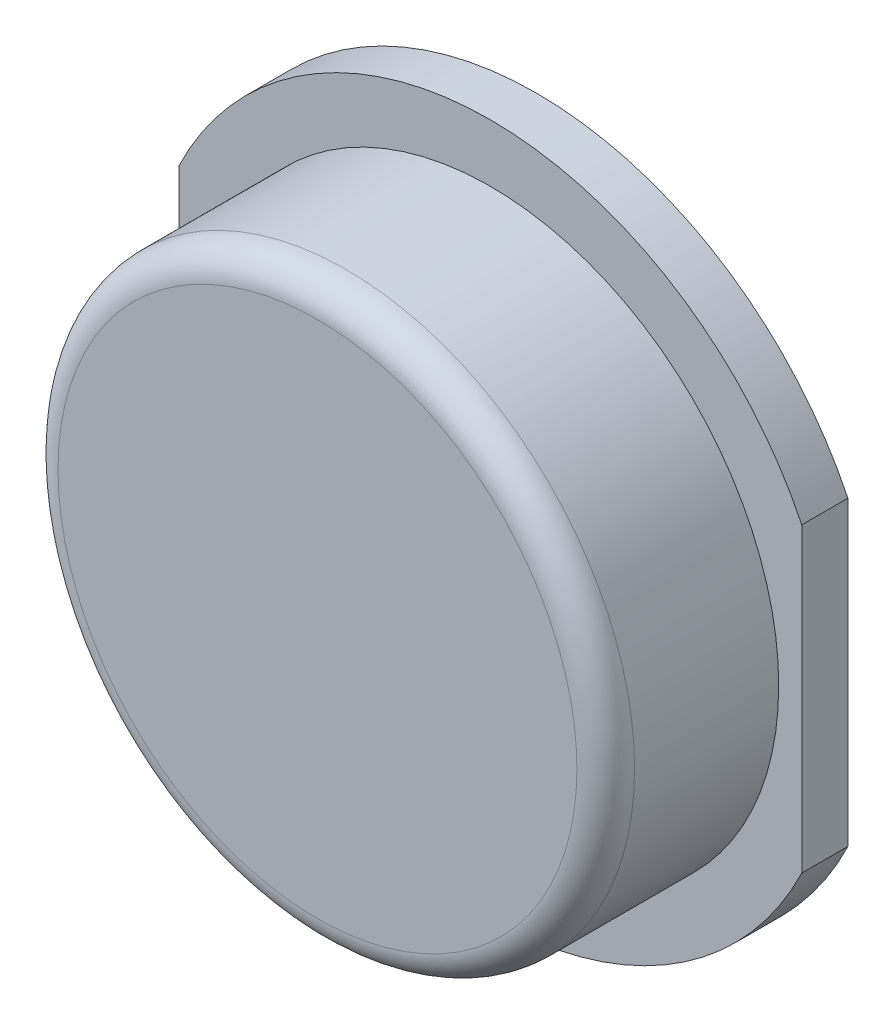
ISO-10303-21;
HEADER;
FILE_DESCRIPTION(('STEP AP214'),'2;1');
FILE_NAME('part.step','',(''),(''),'','','');
FILE_SCHEMA(('AUTOMOTIVE_DESIGN { 1 0 10303 214 1 1 1 1 }'));
ENDSEC;
DATA;
#1=APPLICATION_CONTEXT('core data for automotive mechanical design processes');
#2=APPLICATION_PROTOCOL_DEFINITION('international standard','automotive_design',2000,#1);
#3=PRODUCT_CONTEXT('',#1,'mechanical');
#4=PRODUCT('Part','Part','',(#3));
#5=PRODUCT_RELATED_PRODUCT_CATEGORY('part','',(#4));
#6=PRODUCT_DEFINITION_FORMATION('','',#4);
#7=PRODUCT_DEFINITION_CONTEXT('part definition',#1,'design');
#8=PRODUCT_DEFINITION('design','',#6,#7);
#9=PRODUCT_DEFINITION_SHAPE('','',#8);
#10=(LENGTH_UNIT() NAMED_UNIT(*) SI_UNIT(.MILLI.,.METRE.));
#11=(NAMED_UNIT(*) PLANE_ANGLE_UNIT() SI_UNIT($,.RADIAN.));
#12=(NAMED_UNIT(*) SI_UNIT($,.STERADIAN.) SOLID_ANGLE_UNIT());
#13=UNCERTAINTY_MEASURE_WITH_UNIT(LENGTH_MEASURE(1.E-05),#10,'distance_accuracy_value','');
#14=(GEOMETRIC_REPRESENTATION_CONTEXT(3) GLOBAL_UNCERTAINTY_ASSIGNED_CONTEXT((#13)) GLOBAL_UNIT_ASSIGNED_CONTEXT((#10,
#11,#12)) REPRESENTATION_CONTEXT('',''));
#15=CARTESIAN_POINT('',(0.,0.,0.));
#16=DIRECTION('',(0.,0.,1.));
#17=DIRECTION('',(1.,0.,0.));
#18=AXIS2_PLACEMENT_3D('',#15,#16,#17);
#19=CARTESIAN_POINT('',(0.,0.,3.8));
#20=DIRECTION('',(0.,0.,-1.));
#21=DIRECTION('',(-1.,0.,0.));
#22=AXIS2_PLACEMENT_3D('',#19,#20,#21);
#23=CYLINDRICAL_SURFACE('',#22,3.75);
#24=CARTESIAN_POINT('',(0.,0.,0.));
#25=DIRECTION('',(0.,0.,1.));
#26=DIRECTION('',(1.,0.,0.));
#27=AXIS2_PLACEMENT_3D('',#24,#25,#26);
#28=CIRCLE('',#27,3.75);
#29=CARTESIAN_POINT('',(3.75,0.,0.));
#30=VERTEX_POINT('',#29);
#31=EDGE_CURVE('E104',#30,#30,#28,.T.);
#32=ORIENTED_EDGE('',*,*,#31,.F.);
#33=EDGE_LOOP('',(#32));
#34=FACE_BOUND('',#33,.T.);
#35=CARTESIAN_POINT('',(0.,0.,3.));
#36=DIRECTION('',(0.,0.,1.));
#37=DIRECTION('',(1.,0.,0.));
#38=AXIS2_PLACEMENT_3D('',#35,#36,#37);
#39=CIRCLE('',#38,3.75);
#40=CARTESIAN_POINT('',(3.75,0.,3.));
#41=VERTEX_POINT('',#40);
#42=EDGE_CURVE('E235',#41,#41,#39,.T.);
#43=ORIENTED_EDGE('',*,*,#42,.T.);
#44=EDGE_LOOP('',(#43));
#45=FACE_BOUND('',#44,.T.);
#46=ADVANCED_FACE('F35',(#34,#45),#23,.F.);
#47=CARTESIAN_POINT('',(5.4,0.,0.8));
#48=DIRECTION('',(-1.,0.,0.));
#49=DIRECTION('',(0.,0.,1.));
#50=AXIS2_PLACEMENT_3D('',#47,#48,#49);
#51=PLANE('',#50);
#52=DIRECTION('',(0.,1.,0.));
#53=VECTOR('',#52,1.);
#54=CARTESIAN_POINT('',(5.4,0.,0.));
#55=LINE('',#54,#53);
#56=CARTESIAN_POINT('',(5.4,-2.6153393661244,0.));
#57=VERTEX_POINT('',#56);
#58=CARTESIAN_POINT('',(5.4,2.6153393661244,0.));
#59=VERTEX_POINT('',#58);
#60=EDGE_CURVE('E101',#57,#59,#55,.T.);
#61=ORIENTED_EDGE('',*,*,#60,.T.);
#62=DIRECTION('',(0.,0.,-1.));
#63=VECTOR('',#62,1.);
#64=CARTESIAN_POINT('',(5.4,2.6153393661244,0.8));
#65=LINE('',#64,#63);
#66=CARTESIAN_POINT('',(5.4,2.6153393661244,0.8));
#67=VERTEX_POINT('',#66);
#68=EDGE_CURVE('E94',#67,#59,#65,.T.);
#69=ORIENTED_EDGE('',*,*,#68,.F.);
#70=DIRECTION('',(0.,1.,0.));
#71=VECTOR('',#70,1.);
#72=CARTESIAN_POINT('',(5.4,0.,0.8));
#73=LINE('',#72,#71);
#74=CARTESIAN_POINT('',(5.4,-2.6153393661244,0.8));
#75=VERTEX_POINT('',#74);
#76=EDGE_CURVE('E84',#75,#67,#73,.T.);
#77=ORIENTED_EDGE('',*,*,#76,.F.);
#78=DIRECTION('',(0.,0.,-1.));
#79=VECTOR('',#78,1.);
#80=CARTESIAN_POINT('',(5.4,-2.6153393661244,0.8));
#81=LINE('',#80,#79);
#82=EDGE_CURVE('E98',#75,#57,#81,.T.);
#83=ORIENTED_EDGE('',*,*,#82,.T.);
#84=EDGE_LOOP('',(#61,#69,#77,#83));
#85=FACE_BOUND('',#84,.T.);
#86=ADVANCED_FACE('F125',(#85),#51,.F.);
#87=CARTESIAN_POINT('',(0.,0.,0.8));
#88=DIRECTION('',(0.,0.,-1.));
#89=DIRECTION('',(-1.,0.,0.));
#90=AXIS2_PLACEMENT_3D('',#87,#88,#89);
#91=CYLINDRICAL_SURFACE('',#90,6.);
#92=CARTESIAN_POINT('',(0.,0.,0.));
#93=DIRECTION('',(0.,0.,1.));
#94=DIRECTION('',(1.,0.,0.));
#95=AXIS2_PLACEMENT_3D('',#92,#93,#94);
#96=CIRCLE('',#95,6.);
#97=CARTESIAN_POINT('',(-5.4,2.6153393661244,0.));
#98=VERTEX_POINT('',#97);
#99=EDGE_CURVE('E90',#59,#98,#96,.T.);
#100=ORIENTED_EDGE('',*,*,#99,.T.);
#101=DIRECTION('',(0.,0.,-1.));
#102=VECTOR('',#101,1.);
#103=CARTESIAN_POINT('',(-5.4,2.6153393661244,0.8));
#104=LINE('',#103,#102);
#105=CARTESIAN_POINT('',(-5.4,2.6153393661244,0.8));
#106=VERTEX_POINT('',#105);
#107=EDGE_CURVE('E88',#106,#98,#104,.T.);
#108=ORIENTED_EDGE('',*,*,#107,.F.);
#109=CARTESIAN_POINT('',(0.,0.,0.8));
#110=DIRECTION('',(0.,0.,1.));
#111=DIRECTION('',(1.,0.,0.));
#112=AXIS2_PLACEMENT_3D('',#109,#110,#111);
#113=CIRCLE('',#112,6.);
#114=EDGE_CURVE('E79',#67,#106,#113,.T.);
#115=ORIENTED_EDGE('',*,*,#114,.F.);
#116=ORIENTED_EDGE('',*,*,#68,.T.);
#117=EDGE_LOOP('',(#100,#108,#115,#116));
#118=FACE_BOUND('',#117,.T.);
#119=ADVANCED_FACE('F89',(#118),#91,.T.);
#120=CARTESIAN_POINT('',(-5.4,0.,0.8));
#121=DIRECTION('',(-1.,0.,0.));
#122=DIRECTION('',(0.,0.,1.));
#123=AXIS2_PLACEMENT_3D('',#120,#121,#122);
#124=PLANE('',#123);
#125=DIRECTION('',(0.,1.,0.));
#126=VECTOR('',#125,1.);
#127=CARTESIAN_POINT('',(-5.4,0.,0.));
#128=LINE('',#127,#126);
#129=CARTESIAN_POINT('',(-5.4,-2.6153393661244,0.));
#130=VERTEX_POINT('',#129);
#131=EDGE_CURVE('E106',#130,#98,#128,.T.);
#132=ORIENTED_EDGE('',*,*,#131,.F.);
#133=DIRECTION('',(0.,0.,-1.));
#134=VECTOR('',#133,1.);
#135=CARTESIAN_POINT('',(-5.4,-2.6153393661244,0.8));
#136=LINE('',#135,#134);
#137=CARTESIAN_POINT('',(-5.4,-2.6153393661244,0.8));
#138=VERTEX_POINT('',#137);
#139=EDGE_CURVE('E68',#138,#130,#136,.T.);
#140=ORIENTED_EDGE('',*,*,#139,.F.);
#141=DIRECTION('',(0.,1.,0.));
#142=VECTOR('',#141,1.);
#143=CARTESIAN_POINT('',(-5.4,0.,0.8));
#144=LINE('',#143,#142);
#145=EDGE_CURVE('E82',#138,#106,#144,.T.);
#146=ORIENTED_EDGE('',*,*,#145,.T.);
#147=ORIENTED_EDGE('',*,*,#107,.T.);
#148=EDGE_LOOP('',(#132,#140,#146,#147));
#149=FACE_BOUND('',#148,.T.);
#150=ADVANCED_FACE('F96',(#149),#124,.T.);
#151=EDGE_CURVE('E71',#130,#57,#96,.T.);
#152=ORIENTED_EDGE('',*,*,#151,.T.);
#153=ORIENTED_EDGE('',*,*,#82,.F.);
#154=EDGE_CURVE('E52',#138,#75,#113,.T.);
#155=ORIENTED_EDGE('',*,*,#154,.F.);
#156=ORIENTED_EDGE('',*,*,#139,.T.);
#157=EDGE_LOOP('',(#152,#153,#155,#156));
#158=FACE_BOUND('',#157,.T.);
#159=ADVANCED_FACE('F141',(#158),#91,.T.);
#160=CARTESIAN_POINT('',(0.,0.,0.8));
#161=DIRECTION('',(0.,0.,1.));
#162=DIRECTION('',(1.,0.,0.));
#163=AXIS2_PLACEMENT_3D('',#160,#161,#162);
#164=PLANE('',#163);
#165=CARTESIAN_POINT('',(0.,0.,0.8));
#166=DIRECTION('',(0.,0.,1.));
#167=DIRECTION('',(1.,0.,0.));
#168=AXIS2_PLACEMENT_3D('',#165,#166,#167);
#169=CIRCLE('',#168,5.);
#170=CARTESIAN_POINT('',(5.,0.,0.8));
#171=VERTEX_POINT('',#170);
#172=EDGE_CURVE('E230',#171,#171,#169,.T.);
#173=ORIENTED_EDGE('',*,*,#172,.F.);
#174=EDGE_LOOP('',(#173));
#175=FACE_BOUND('',#174,.T.);
#176=ORIENTED_EDGE('',*,*,#76,.T.);
#177=ORIENTED_EDGE('',*,*,#114,.T.);
#178=ORIENTED_EDGE('',*,*,#145,.F.);
#179=ORIENTED_EDGE('',*,*,#154,.T.);
#180=EDGE_LOOP('',(#176,#177,#178,#179));
#181=FACE_BOUND('',#180,.T.);
#182=ADVANCED_FACE('F80',(#175,#181),#164,.T.);
#183=CARTESIAN_POINT('',(0.,0.,0.));
#184=DIRECTION('',(0.,0.,1.));
#185=DIRECTION('',(1.,0.,0.));
#186=AXIS2_PLACEMENT_3D('',#183,#184,#185);
#187=PLANE('',#186);
#188=ORIENTED_EDGE('',*,*,#60,.F.);
#189=ORIENTED_EDGE('',*,*,#151,.F.);
#190=ORIENTED_EDGE('',*,*,#131,.T.);
#191=ORIENTED_EDGE('',*,*,#99,.F.);
#192=EDGE_LOOP('',(#188,#189,#190,#191));
#193=FACE_BOUND('',#192,.T.);
#194=ORIENTED_EDGE('',*,*,#31,.T.);
#195=EDGE_LOOP('',(#194));
#196=FACE_BOUND('',#195,.T.);
#197=ADVANCED_FACE('F140',(#193,#196),#187,.F.);
#198=CARTESIAN_POINT('',(0.,0.,3.8));
#199=DIRECTION('',(0.,0.,-1.));
#200=DIRECTION('',(-1.,0.,0.));
#201=AXIS2_PLACEMENT_3D('',#198,#199,#200);
#202=CYLINDRICAL_SURFACE('',#201,5.);
#203=CARTESIAN_POINT('',(0.,0.,3.3));
#204=DIRECTION('',(0.,0.,1.));
#205=DIRECTION('',(1.,0.,0.));
#206=AXIS2_PLACEMENT_3D('',#203,#204,#205);
#207=CIRCLE('',#206,5.);
#208=CARTESIAN_POINT('',(5.,0.,3.3));
#209=VERTEX_POINT('',#208);
#210=EDGE_CURVE('E11',#209,#209,#207,.F.);
#211=ORIENTED_EDGE('',*,*,#210,.T.);
#212=EDGE_LOOP('',(#211));
#213=FACE_BOUND('',#212,.T.);
#214=ORIENTED_EDGE('',*,*,#172,.T.);
#215=EDGE_LOOP('',(#214));
#216=FACE_BOUND('',#215,.T.);
#217=ADVANCED_FACE('F136',(#213,#216),#202,.T.);
#218=CARTESIAN_POINT('',(0.,0.,3.8));
#219=DIRECTION('',(0.,0.,1.));
#220=DIRECTION('',(1.,0.,0.));
#221=AXIS2_PLACEMENT_3D('',#218,#219,#220);
#222=PLANE('',#221);
#223=CARTESIAN_POINT('',(0.,0.,3.8));
#224=DIRECTION('',(0.,0.,1.));
#225=DIRECTION('',(1.,0.,0.));
#226=AXIS2_PLACEMENT_3D('',#223,#224,#225);
#227=CIRCLE('',#226,4.5);
#228=CARTESIAN_POINT('',(4.5,0.,3.8));
#229=VERTEX_POINT('',#228);
#230=EDGE_CURVE('E44',#229,#229,#227,.T.);
#231=ORIENTED_EDGE('',*,*,#230,.T.);
#232=EDGE_LOOP('',(#231));
#233=FACE_BOUND('',#232,.T.);
#234=ADVANCED_FACE('F113',(#233),#222,.T.);
#235=CARTESIAN_POINT('',(0.,0.,3.));
#236=DIRECTION('',(0.,0.,1.));
#237=DIRECTION('',(1.,0.,0.));
#238=AXIS2_PLACEMENT_3D('',#235,#236,#237);
#239=PLANE('',#238);
#240=ORIENTED_EDGE('',*,*,#42,.F.);
#241=EDGE_LOOP('',(#240));
#242=FACE_BOUND('',#241,.T.);
#243=ADVANCED_FACE('F116',(#242),#239,.F.);
#244=CARTESIAN_POINT('',(0.,0.,3.3));
#245=DIRECTION('',(0.,0.,1.));
#246=DIRECTION('',(1.,0.,0.));
#247=AXIS2_PLACEMENT_3D('',#244,#245,#246);
#248=TOROIDAL_SURFACE('',#247,4.5,0.5);
#249=ORIENTED_EDGE('',*,*,#210,.F.);
#250=EDGE_LOOP('',(#249));
#251=FACE_BOUND('',#250,.T.);
#252=ORIENTED_EDGE('',*,*,#230,.F.);
#253=EDGE_LOOP('',(#252));
#254=FACE_BOUND('',#253,.T.);
#255=ADVANCED_FACE('F37',(#251,#254),#248,.T.);
#256=CLOSED_SHELL('',(#46,#86,#119,#150,#159,#182,#197,#217,#234,#243,#255));
#257=MANIFOLD_SOLID_BREP('B2',#256);
#258=ADVANCED_BREP_SHAPE_REPRESENTATION('',(#18,#257),#14);
#259=SHAPE_DEFINITION_REPRESENTATION(#9,#258);
ENDSEC;
END-ISO-10303-21;
